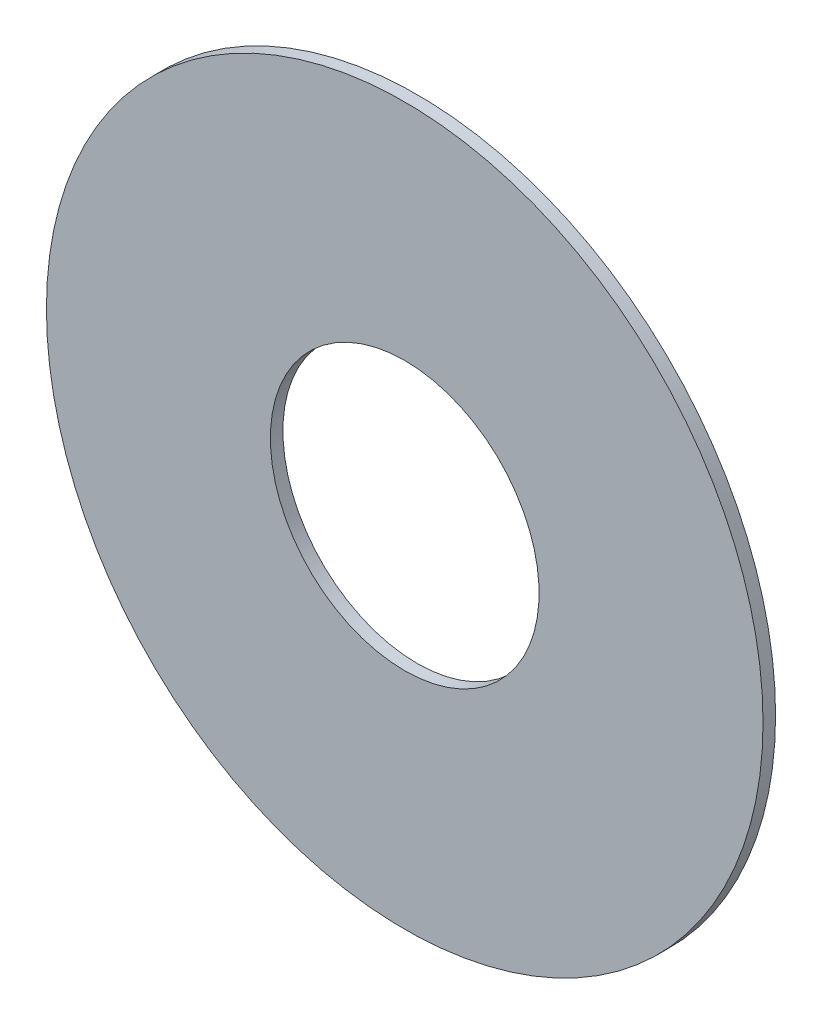
ISO-10303-21;
HEADER;
FILE_DESCRIPTION(('STEP AP214'),'2;1');
FILE_NAME('part.step','',(''),(''),'','','');
FILE_SCHEMA(('AUTOMOTIVE_DESIGN { 1 0 10303 214 1 1 1 1 }'));
ENDSEC;
DATA;
#1=APPLICATION_CONTEXT('core data for automotive mechanical design processes');
#2=APPLICATION_PROTOCOL_DEFINITION('international standard','automotive_design',2000,#1);
#3=PRODUCT_CONTEXT('',#1,'mechanical');
#4=PRODUCT('Part','Part','',(#3));
#5=PRODUCT_RELATED_PRODUCT_CATEGORY('part','',(#4));
#6=PRODUCT_DEFINITION_FORMATION('','',#4);
#7=PRODUCT_DEFINITION_CONTEXT('part definition',#1,'design');
#8=PRODUCT_DEFINITION('design','',#6,#7);
#9=PRODUCT_DEFINITION_SHAPE('','',#8);
#10=(LENGTH_UNIT() NAMED_UNIT(*) SI_UNIT(.MILLI.,.METRE.));
#11=(NAMED_UNIT(*) PLANE_ANGLE_UNIT() SI_UNIT($,.RADIAN.));
#12=(NAMED_UNIT(*) SI_UNIT($,.STERADIAN.) SOLID_ANGLE_UNIT());
#13=UNCERTAINTY_MEASURE_WITH_UNIT(LENGTH_MEASURE(1.E-05),#10,'distance_accuracy_value','');
#14=(GEOMETRIC_REPRESENTATION_CONTEXT(3) GLOBAL_UNCERTAINTY_ASSIGNED_CONTEXT((#13)) GLOBAL_UNIT_ASSIGNED_CONTEXT((#10,
#11,#12)) REPRESENTATION_CONTEXT('',''));
#15=CARTESIAN_POINT('',(0.,0.,0.));
#16=DIRECTION('',(0.,0.,1.));
#17=DIRECTION('',(1.,0.,0.));
#18=AXIS2_PLACEMENT_3D('',#15,#16,#17);
#19=CARTESIAN_POINT('',(148.844,-73.152,-0.045));
#20=DIRECTION('',(0.,0.,-1.));
#21=DIRECTION('',(0.,-1.,0.));
#22=AXIS2_PLACEMENT_3D('',#19,#20,#21);
#23=CYLINDRICAL_SURFACE('',#22,0.375);
#24=CARTESIAN_POINT('',(148.844,-73.152,1.67));
#25=DIRECTION('',(0.,0.,-1.));
#26=DIRECTION('',(0.,-1.,0.));
#27=AXIS2_PLACEMENT_3D('',#24,#25,#26);
#28=CIRCLE('',#27,0.375);
#29=CARTESIAN_POINT('',(148.844,-73.527,1.67));
#30=VERTEX_POINT('',#29);
#31=EDGE_CURVE('E25',#30,#30,#28,.T.);
#32=ORIENTED_EDGE('',*,*,#31,.T.);
#33=DIRECTION('',(0.,0.,1.));
#34=VECTOR('',#33,1.);
#35=CARTESIAN_POINT('',(148.844,-73.527,-0.045));
#36=LINE('',#35,#34);
#37=CARTESIAN_POINT('',(148.844,-73.527,1.705));
#38=VERTEX_POINT('',#37);
#39=EDGE_CURVE('E11',#30,#38,#36,.T.);
#40=ORIENTED_EDGE('',*,*,#39,.T.);
#41=CARTESIAN_POINT('',(148.844,-73.152,1.705));
#42=DIRECTION('',(0.,0.,-1.));
#43=DIRECTION('',(0.,-1.,0.));
#44=AXIS2_PLACEMENT_3D('',#41,#42,#43);
#45=CIRCLE('',#44,0.375);
#46=EDGE_CURVE('E68',#38,#38,#45,.T.);
#47=ORIENTED_EDGE('',*,*,#46,.F.);
#48=ORIENTED_EDGE('',*,*,#39,.F.);
#49=EDGE_LOOP('',(#32,#40,#47,#48));
#50=FACE_BOUND('',#49,.T.);
#51=ADVANCED_FACE('F17',(#50),#23,.F.);
#52=CARTESIAN_POINT('',(148.844,-73.152,1.67));
#53=DIRECTION('',(0.,0.,1.));
#54=DIRECTION('',(1.,0.,0.));
#55=AXIS2_PLACEMENT_3D('',#52,#53,#54);
#56=PLANE('',#55);
#57=ORIENTED_EDGE('',*,*,#31,.F.);
#58=EDGE_LOOP('',(#57));
#59=FACE_BOUND('',#58,.T.);
#60=CARTESIAN_POINT('',(148.844,-73.152,1.67));
#61=DIRECTION('',(0.,0.,1.));
#62=DIRECTION('',(1.,0.,0.));
#63=AXIS2_PLACEMENT_3D('',#60,#61,#62);
#64=CIRCLE('',#63,1.);
#65=CARTESIAN_POINT('',(149.844,-73.152,1.67));
#66=VERTEX_POINT('',#65);
#67=EDGE_CURVE('E56',#66,#66,#64,.T.);
#68=ORIENTED_EDGE('',*,*,#67,.F.);
#69=EDGE_LOOP('',(#68));
#70=FACE_BOUND('',#69,.T.);
#71=ADVANCED_FACE('F102',(#59,#70),#56,.F.);
#72=CARTESIAN_POINT('',(148.844,-73.152,1.705));
#73=DIRECTION('',(0.,0.,1.));
#74=DIRECTION('',(1.,0.,0.));
#75=AXIS2_PLACEMENT_3D('',#72,#73,#74);
#76=PLANE('',#75);
#77=ORIENTED_EDGE('',*,*,#46,.T.);
#78=EDGE_LOOP('',(#77));
#79=FACE_BOUND('',#78,.T.);
#80=CARTESIAN_POINT('',(148.844,-73.152,1.705));
#81=DIRECTION('',(0.,0.,1.));
#82=DIRECTION('',(1.,0.,0.));
#83=AXIS2_PLACEMENT_3D('',#80,#81,#82);
#84=CIRCLE('',#83,1.);
#85=CARTESIAN_POINT('',(149.844,-73.152,1.705));
#86=VERTEX_POINT('',#85);
#87=EDGE_CURVE('E54',#86,#86,#84,.T.);
#88=ORIENTED_EDGE('',*,*,#87,.T.);
#89=EDGE_LOOP('',(#88));
#90=FACE_BOUND('',#89,.T.);
#91=ADVANCED_FACE('F60',(#79,#90),#76,.T.);
#92=CARTESIAN_POINT('',(148.844,-73.152,1.67));
#93=DIRECTION('',(0.,0.,1.));
#94=DIRECTION('',(1.,0.,0.));
#95=AXIS2_PLACEMENT_3D('',#92,#93,#94);
#96=CYLINDRICAL_SURFACE('',#95,1.);
#97=ORIENTED_EDGE('',*,*,#87,.F.);
#98=DIRECTION('',(0.,0.,1.));
#99=VECTOR('',#98,1.);
#100=CARTESIAN_POINT('',(149.844,-73.152,1.67));
#101=LINE('',#100,#99);
#102=EDGE_CURVE('E51',#66,#86,#101,.T.);
#103=ORIENTED_EDGE('',*,*,#102,.F.);
#104=ORIENTED_EDGE('',*,*,#67,.T.);
#105=ORIENTED_EDGE('',*,*,#102,.T.);
#106=EDGE_LOOP('',(#97,#103,#104,#105));
#107=FACE_BOUND('',#106,.T.);
#108=ADVANCED_FACE('F53',(#107),#96,.T.);
#109=CLOSED_SHELL('',(#51,#71,#91,#108));
#110=MANIFOLD_SOLID_BREP('B1',#109);
#111=ADVANCED_BREP_SHAPE_REPRESENTATION('',(#18,#110),#14);
#112=SHAPE_DEFINITION_REPRESENTATION(#9,#111);
ENDSEC;
END-ISO-10303-21;
